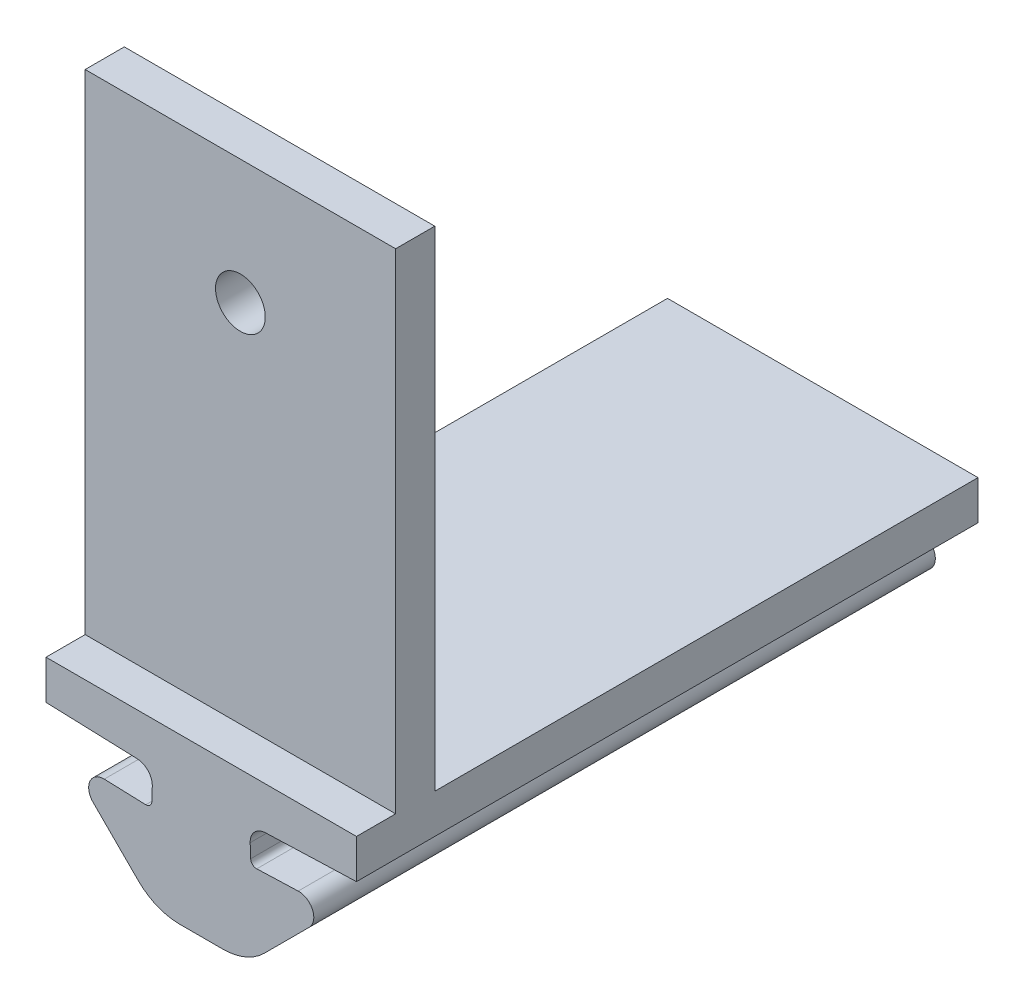
ISO-10303-21;
HEADER;
FILE_DESCRIPTION(('STEP AP214'),'2;1');
FILE_NAME('part.step','',(''),(''),'','','');
FILE_SCHEMA(('AUTOMOTIVE_DESIGN { 1 0 10303 214 1 1 1 1 }'));
ENDSEC;
DATA;
#1=APPLICATION_CONTEXT('core data for automotive mechanical design processes');
#2=APPLICATION_PROTOCOL_DEFINITION('international standard','automotive_design',2000,#1);
#3=PRODUCT_CONTEXT('',#1,'mechanical');
#4=PRODUCT('Part','Part','',(#3));
#5=PRODUCT_RELATED_PRODUCT_CATEGORY('part','',(#4));
#6=PRODUCT_DEFINITION_FORMATION('','',#4);
#7=PRODUCT_DEFINITION_CONTEXT('part definition',#1,'design');
#8=PRODUCT_DEFINITION('design','',#6,#7);
#9=PRODUCT_DEFINITION_SHAPE('','',#8);
#10=(LENGTH_UNIT() NAMED_UNIT(*) SI_UNIT(.MILLI.,.METRE.));
#11=(NAMED_UNIT(*) PLANE_ANGLE_UNIT() SI_UNIT($,.RADIAN.));
#12=(NAMED_UNIT(*) SI_UNIT($,.STERADIAN.) SOLID_ANGLE_UNIT());
#13=UNCERTAINTY_MEASURE_WITH_UNIT(LENGTH_MEASURE(1.E-05),#10,'distance_accuracy_value','');
#14=(GEOMETRIC_REPRESENTATION_CONTEXT(3) GLOBAL_UNCERTAINTY_ASSIGNED_CONTEXT((#13)) GLOBAL_UNIT_ASSIGNED_CONTEXT((#10,
#11,#12)) REPRESENTATION_CONTEXT('',''));
#15=CARTESIAN_POINT('',(0.,0.,0.));
#16=DIRECTION('',(0.,0.,1.));
#17=DIRECTION('',(1.,0.,0.));
#18=AXIS2_PLACEMENT_3D('',#15,#16,#17);
#19=CARTESIAN_POINT('',(0.,49.2995338889829,0.));
#20=DIRECTION('',(0.,1.,0.));
#21=DIRECTION('',(0.,0.,1.));
#22=AXIS2_PLACEMENT_3D('',#19,#20,#21);
#23=PLANE('',#22);
#24=DIRECTION('',(-1.,0.,0.));
#25=VECTOR('',#24,1.);
#26=CARTESIAN_POINT('',(-55.7809025544344,49.2995338889829,27.75));
#27=LINE('',#26,#25);
#28=CARTESIAN_POINT('',(-39.9205005412442,49.2995338889829,27.75));
#29=VERTEX_POINT('',#28);
#30=CARTESIAN_POINT('',(-55.7809025544344,49.2995338889829,27.75));
#31=VERTEX_POINT('',#30);
#32=EDGE_CURVE('E63',#29,#31,#27,.T.);
#33=ORIENTED_EDGE('',*,*,#32,.F.);
#34=DIRECTION('',(0.,0.,-1.));
#35=VECTOR('',#34,1.);
#36=CARTESIAN_POINT('',(-39.9205005412442,49.2995338889829,0.));
#37=LINE('',#36,#35);
#38=CARTESIAN_POINT('',(-39.9205005412442,49.2995338889829,0.));
#39=VERTEX_POINT('',#38);
#40=EDGE_CURVE('E249',#29,#39,#37,.T.);
#41=ORIENTED_EDGE('',*,*,#40,.T.);
#42=DIRECTION('',(-1.,0.,0.));
#43=VECTOR('',#42,1.);
#44=CARTESIAN_POINT('',(-55.7809025544344,49.2995338889829,0.));
#45=LINE('',#44,#43);
#46=CARTESIAN_POINT('',(-55.7809025544344,49.2995338889829,0.));
#47=VERTEX_POINT('',#46);
#48=EDGE_CURVE('E253',#39,#47,#45,.T.);
#49=ORIENTED_EDGE('',*,*,#48,.T.);
#50=DIRECTION('',(0.,0.,1.));
#51=VECTOR('',#50,1.);
#52=CARTESIAN_POINT('',(-55.7809025544344,49.2995338889829,0.));
#53=LINE('',#52,#51);
#54=EDGE_CURVE('E239',#47,#31,#53,.T.);
#55=ORIENTED_EDGE('',*,*,#54,.T.);
#56=EDGE_LOOP('',(#33,#41,#49,#55));
#57=FACE_BOUND('',#56,.T.);
#58=ADVANCED_FACE('F47',(#57),#23,.T.);
#59=CARTESIAN_POINT('',(-50.6754357820215,45.6203327442278,31.75));
#60=DIRECTION('',(0.,0.,-1.));
#61=DIRECTION('',(-1.,0.,0.));
#62=AXIS2_PLACEMENT_3D('',#59,#60,#61);
#63=CYLINDRICAL_SURFACE('',#62,0.300000000000002);
#64=CARTESIAN_POINT('',(-50.6754357820215,45.6203327442278,0.));
#65=DIRECTION('',(0.,0.,-1.));
#66=DIRECTION('',(1.,0.,0.));
#67=AXIS2_PLACEMENT_3D('',#64,#65,#66);
#68=CIRCLE('',#67,0.300000000000002);
#69=CARTESIAN_POINT('',(-50.3756185339158,45.609862895217,0.));
#70=VERTEX_POINT('',#69);
#71=CARTESIAN_POINT('',(-50.6859056310322,45.320515496122,0.));
#72=VERTEX_POINT('',#71);
#73=EDGE_CURVE('E365',#70,#72,#68,.T.);
#74=ORIENTED_EDGE('',*,*,#73,.T.);
#75=DIRECTION('',(0.,0.,-1.));
#76=VECTOR('',#75,1.);
#77=CARTESIAN_POINT('',(-50.6859056310322,45.320515496122,31.75));
#78=LINE('',#77,#76);
#79=CARTESIAN_POINT('',(-50.6859056310322,45.320515496122,31.75));
#80=VERTEX_POINT('',#79);
#81=EDGE_CURVE('E11',#80,#72,#78,.T.);
#82=ORIENTED_EDGE('',*,*,#81,.F.);
#83=CARTESIAN_POINT('',(-50.6754357820215,45.6203327442278,31.75));
#84=DIRECTION('',(0.,0.,-1.));
#85=DIRECTION('',(1.,0.,0.));
#86=AXIS2_PLACEMENT_3D('',#83,#84,#85);
#87=CIRCLE('',#86,0.300000000000002);
#88=CARTESIAN_POINT('',(-50.3756185339158,45.609862895217,31.75));
#89=VERTEX_POINT('',#88);
#90=EDGE_CURVE('E366',#89,#80,#87,.T.);
#91=ORIENTED_EDGE('',*,*,#90,.F.);
#92=DIRECTION('',(0.,0.,-1.));
#93=VECTOR('',#92,1.);
#94=CARTESIAN_POINT('',(-50.3756185339158,45.609862895217,31.75));
#95=LINE('',#94,#93);
#96=EDGE_CURVE('E395',#89,#70,#95,.T.);
#97=ORIENTED_EDGE('',*,*,#96,.T.);
#98=EDGE_LOOP('',(#74,#82,#91,#97));
#99=FACE_BOUND('',#98,.T.);
#100=ADVANCED_FACE('F49',(#99),#63,.F.);
#101=CARTESIAN_POINT('',(-50.6859056310322,45.320515496122,31.75));
#102=DIRECTION('',(-0.0348994967024436,-0.999390827019098,0.));
#103=DIRECTION('',(0.999390827019098,-0.0348994967024436,0.));
#104=AXIS2_PLACEMENT_3D('',#101,#102,#103);
#105=PLANE('',#104);
#106=DIRECTION('',(-0.999390827019098,0.0348994967024436,0.));
#107=VECTOR('',#106,1.);
#108=CARTESIAN_POINT('',(-50.6859056310322,45.320515496122,0.));
#109=LINE('',#108,#107);
#110=CARTESIAN_POINT('',(-52.803734095959,45.3944716957687,0.));
#111=VERTEX_POINT('',#110);
#112=EDGE_CURVE('E399',#72,#111,#109,.T.);
#113=ORIENTED_EDGE('',*,*,#112,.T.);
#114=DIRECTION('',(0.,0.,-1.));
#115=VECTOR('',#114,1.);
#116=CARTESIAN_POINT('',(-52.803734095959,45.3944716957687,31.75));
#117=LINE('',#116,#115);
#118=CARTESIAN_POINT('',(-52.803734095959,45.3944716957687,31.75));
#119=VERTEX_POINT('',#118);
#120=EDGE_CURVE('E56',#119,#111,#117,.T.);
#121=ORIENTED_EDGE('',*,*,#120,.F.);
#122=DIRECTION('',(-0.999390827019098,0.0348994967024436,0.));
#123=VECTOR('',#122,1.);
#124=CARTESIAN_POINT('',(-50.6859056310322,45.320515496122,31.75));
#125=LINE('',#124,#123);
#126=EDGE_CURVE('E370',#80,#119,#125,.T.);
#127=ORIENTED_EDGE('',*,*,#126,.F.);
#128=ORIENTED_EDGE('',*,*,#81,.T.);
#129=EDGE_LOOP('',(#113,#121,#127,#128));
#130=FACE_BOUND('',#129,.T.);
#131=ADVANCED_FACE('F477',(#130),#105,.F.);
#132=CARTESIAN_POINT('',(-52.8306099066512,44.6248491736012,31.75));
#133=DIRECTION('',(0.,0.,-1.));
#134=DIRECTION('',(-1.,0.,0.));
#135=AXIS2_PLACEMENT_3D('',#132,#133,#134);
#136=CYLINDRICAL_SURFACE('',#135,0.770091641188153);
#137=CARTESIAN_POINT('',(-52.8306099066512,44.6248491736012,0.));
#138=DIRECTION('',(0.,0.,1.));
#139=DIRECTION('',(1.,0.,0.));
#140=AXIS2_PLACEMENT_3D('',#137,#138,#139);
#141=CIRCLE('',#140,0.770091641188153);
#142=CARTESIAN_POINT('',(-53.3751469282704,44.0803121519819,0.));
#143=VERTEX_POINT('',#142);
#144=EDGE_CURVE('E402',#111,#143,#141,.T.);
#145=ORIENTED_EDGE('',*,*,#144,.T.);
#146=DIRECTION('',(0.,0.,-1.));
#147=VECTOR('',#146,1.);
#148=CARTESIAN_POINT('',(-53.3751469282704,44.0803121519819,31.75));
#149=LINE('',#148,#147);
#150=CARTESIAN_POINT('',(-53.3751469282704,44.0803121519819,31.75));
#151=VERTEX_POINT('',#150);
#152=EDGE_CURVE('E444',#151,#143,#149,.T.);
#153=ORIENTED_EDGE('',*,*,#152,.F.);
#154=CARTESIAN_POINT('',(-52.8306099066512,44.6248491736012,31.75));
#155=DIRECTION('',(0.,0.,1.));
#156=DIRECTION('',(1.,0.,0.));
#157=AXIS2_PLACEMENT_3D('',#154,#155,#156);
#158=CIRCLE('',#157,0.770091641188153);
#159=EDGE_CURVE('E374',#119,#151,#158,.T.);
#160=ORIENTED_EDGE('',*,*,#159,.F.);
#161=ORIENTED_EDGE('',*,*,#120,.T.);
#162=EDGE_LOOP('',(#145,#153,#160,#161));
#163=FACE_BOUND('',#162,.T.);
#164=ADVANCED_FACE('F453',(#163),#136,.T.);
#165=CARTESIAN_POINT('',(-51.0742666676735,41.7794318913851,31.75));
#166=DIRECTION('',(0.707106781186544,0.707106781186551,0.));
#167=DIRECTION('',(-0.707106781186551,0.707106781186544,0.));
#168=AXIS2_PLACEMENT_3D('',#165,#166,#167);
#169=PLANE('',#168);
#170=DIRECTION('',(0.707106781186551,-0.707106781186544,0.));
#171=VECTOR('',#170,1.);
#172=CARTESIAN_POINT('',(-51.0742666676735,41.7794318913851,0.));
#173=LINE('',#172,#171);
#174=CARTESIAN_POINT('',(-51.0742666676735,41.7794318913851,0.));
#175=VERTEX_POINT('',#174);
#176=EDGE_CURVE('E405',#143,#175,#173,.T.);
#177=ORIENTED_EDGE('',*,*,#176,.T.);
#178=DIRECTION('',(0.,0.,-1.));
#179=VECTOR('',#178,1.);
#180=CARTESIAN_POINT('',(-51.0742666676735,41.7794318913851,31.75));
#181=LINE('',#180,#179);
#182=CARTESIAN_POINT('',(-51.0742666676735,41.7794318913851,31.75));
#183=VERTEX_POINT('',#182);
#184=EDGE_CURVE('E440',#183,#175,#181,.T.);
#185=ORIENTED_EDGE('',*,*,#184,.F.);
#186=DIRECTION('',(0.707106781186551,-0.707106781186544,0.));
#187=VECTOR('',#186,1.);
#188=CARTESIAN_POINT('',(-51.0742666676735,41.7794318913851,31.75));
#189=LINE('',#188,#187);
#190=EDGE_CURVE('E377',#151,#183,#189,.T.);
#191=ORIENTED_EDGE('',*,*,#190,.F.);
#192=ORIENTED_EDGE('',*,*,#152,.T.);
#193=EDGE_LOOP('',(#177,#185,#191,#192));
#194=FACE_BOUND('',#193,.T.);
#195=ADVANCED_FACE('F464',(#194),#169,.F.);
#196=CARTESIAN_POINT('',(-48.9529463241139,43.9007522349447,31.75));
#197=DIRECTION('',(0.,0.,-1.));
#198=DIRECTION('',(-1.,0.,0.));
#199=AXIS2_PLACEMENT_3D('',#196,#197,#198);
#200=CYLINDRICAL_SURFACE('',#199,3.);
#201=CARTESIAN_POINT('',(-48.9529463241139,43.9007522349447,0.));
#202=DIRECTION('',(0.,0.,1.));
#203=DIRECTION('',(1.,0.,0.));
#204=AXIS2_PLACEMENT_3D('',#201,#202,#203);
#205=CIRCLE('',#204,3.);
#206=CARTESIAN_POINT('',(-48.9529463241139,40.9007522349447,0.));
#207=VERTEX_POINT('',#206);
#208=EDGE_CURVE('E408',#175,#207,#205,.T.);
#209=ORIENTED_EDGE('',*,*,#208,.T.);
#210=DIRECTION('',(0.,0.,-1.));
#211=VECTOR('',#210,1.);
#212=CARTESIAN_POINT('',(-48.9529463241139,40.9007522349447,31.75));
#213=LINE('',#212,#211);
#214=CARTESIAN_POINT('',(-48.9529463241139,40.9007522349447,31.75));
#215=VERTEX_POINT('',#214);
#216=EDGE_CURVE('E436',#215,#207,#213,.T.);
#217=ORIENTED_EDGE('',*,*,#216,.F.);
#218=CARTESIAN_POINT('',(-48.9529463241139,43.9007522349447,31.75));
#219=DIRECTION('',(0.,0.,1.));
#220=DIRECTION('',(1.,0.,0.));
#221=AXIS2_PLACEMENT_3D('',#218,#219,#220);
#222=CIRCLE('',#221,3.);
#223=EDGE_CURVE('E380',#183,#215,#222,.T.);
#224=ORIENTED_EDGE('',*,*,#223,.F.);
#225=ORIENTED_EDGE('',*,*,#184,.T.);
#226=EDGE_LOOP('',(#209,#217,#224,#225));
#227=FACE_BOUND('',#226,.T.);
#228=ADVANCED_FACE('F468',(#227),#200,.T.);
#229=CARTESIAN_POINT('',(-47.8507015478393,40.9007522349447,31.75));
#230=DIRECTION('',(0.,1.,0.));
#231=DIRECTION('',(0.,0.,1.));
#232=AXIS2_PLACEMENT_3D('',#229,#230,#231);
#233=PLANE('',#232);
#234=DIRECTION('',(1.,0.,0.));
#235=VECTOR('',#234,1.);
#236=CARTESIAN_POINT('',(-47.8507015478393,40.9007522349447,0.));
#237=LINE('',#236,#235);
#238=CARTESIAN_POINT('',(-46.7484567715648,40.9007522349447,0.));
#239=VERTEX_POINT('',#238);
#240=EDGE_CURVE('E411',#207,#239,#237,.T.);
#241=ORIENTED_EDGE('',*,*,#240,.T.);
#242=DIRECTION('',(0.,0.,-1.));
#243=VECTOR('',#242,1.);
#244=CARTESIAN_POINT('',(-46.7484567715648,40.9007522349447,31.75));
#245=LINE('',#244,#243);
#246=CARTESIAN_POINT('',(-46.7484567715648,40.9007522349447,31.75));
#247=VERTEX_POINT('',#246);
#248=EDGE_CURVE('E348',#247,#239,#245,.T.);
#249=ORIENTED_EDGE('',*,*,#248,.F.);
#250=DIRECTION('',(1.,0.,0.));
#251=VECTOR('',#250,1.);
#252=CARTESIAN_POINT('',(-47.8507015478393,40.9007522349447,31.75));
#253=LINE('',#252,#251);
#254=EDGE_CURVE('E383',#215,#247,#253,.T.);
#255=ORIENTED_EDGE('',*,*,#254,.F.);
#256=ORIENTED_EDGE('',*,*,#216,.T.);
#257=EDGE_LOOP('',(#241,#249,#255,#256));
#258=FACE_BOUND('',#257,.T.);
#259=ADVANCED_FACE('F595',(#258),#233,.F.);
#260=CARTESIAN_POINT('',(-55.7809025544344,47.2995338889829,31.75));
#261=DIRECTION('',(0.0348994967024436,0.999390827019098,0.));
#262=DIRECTION('',(-0.999390827019098,0.0348994967024436,0.));
#263=AXIS2_PLACEMENT_3D('',#260,#261,#262);
#264=PLANE('',#263);
#265=DIRECTION('',(0.999390827019098,-0.0348994967024436,0.));
#266=VECTOR('',#265,1.);
#267=CARTESIAN_POINT('',(-55.7809025544344,47.2995338889829,0.));
#268=LINE('',#267,#266);
#269=CARTESIAN_POINT('',(-55.7809025544344,47.2995338889829,0.));
#270=VERTEX_POINT('',#269);
#271=CARTESIAN_POINT('',(-51.1227819504774,47.1368687331076,0.));
#272=VERTEX_POINT('',#271);
#273=EDGE_CURVE('E414',#270,#272,#268,.T.);
#274=ORIENTED_EDGE('',*,*,#273,.T.);
#275=DIRECTION('',(0.,0.,-1.));
#276=VECTOR('',#275,1.);
#277=CARTESIAN_POINT('',(-51.1227819504774,47.1368687331076,31.75));
#278=LINE('',#277,#276);
#279=CARTESIAN_POINT('',(-51.1227819504774,47.1368687331076,31.75));
#280=VERTEX_POINT('',#279);
#281=EDGE_CURVE('E429',#280,#272,#278,.T.);
#282=ORIENTED_EDGE('',*,*,#281,.F.);
#283=DIRECTION('',(0.999390827019098,-0.0348994967024436,0.));
#284=VECTOR('',#283,1.);
#285=CARTESIAN_POINT('',(-55.7809025544344,47.2995338889829,31.75));
#286=LINE('',#285,#284);
#287=CARTESIAN_POINT('',(-55.7809025544344,47.2995338889829,31.75));
#288=VERTEX_POINT('',#287);
#289=EDGE_CURVE('E386',#288,#280,#286,.T.);
#290=ORIENTED_EDGE('',*,*,#289,.F.);
#291=DIRECTION('',(0.,0.,-1.));
#292=VECTOR('',#291,1.);
#293=CARTESIAN_POINT('',(-55.7809025544344,47.2995338889829,31.75));
#294=LINE('',#293,#292);
#295=EDGE_CURVE('E433',#288,#270,#294,.T.);
#296=ORIENTED_EDGE('',*,*,#295,.T.);
#297=EDGE_LOOP('',(#274,#282,#290,#296));
#298=FACE_BOUND('',#297,.T.);
#299=ADVANCED_FACE('F492',(#298),#264,.F.);
#300=CARTESIAN_POINT('',(-51.1507015478393,46.3373560714924,31.75));
#301=DIRECTION('',(0.,0.,-1.));
#302=DIRECTION('',(-1.,0.,0.));
#303=AXIS2_PLACEMENT_3D('',#300,#301,#302);
#304=CYLINDRICAL_SURFACE('',#303,0.799999999999997);
#305=CARTESIAN_POINT('',(-51.1507015478393,46.3373560714924,0.));
#306=DIRECTION('',(0.,0.,-1.));
#307=DIRECTION('',(1.,0.,0.));
#308=AXIS2_PLACEMENT_3D('',#305,#306,#307);
#309=CIRCLE('',#308,0.799999999999997);
#310=CARTESIAN_POINT('',(-50.3511888862241,46.3094364741304,0.));
#311=VERTEX_POINT('',#310);
#312=EDGE_CURVE('E417',#272,#311,#309,.T.);
#313=ORIENTED_EDGE('',*,*,#312,.T.);
#314=DIRECTION('',(0.,0.,-1.));
#315=VECTOR('',#314,1.);
#316=CARTESIAN_POINT('',(-50.3511888862241,46.3094364741304,31.75));
#317=LINE('',#316,#315);
#318=CARTESIAN_POINT('',(-50.3511888862241,46.3094364741304,31.75));
#319=VERTEX_POINT('',#318);
#320=EDGE_CURVE('E425',#319,#311,#317,.T.);
#321=ORIENTED_EDGE('',*,*,#320,.F.);
#322=CARTESIAN_POINT('',(-51.1507015478393,46.3373560714924,31.75));
#323=DIRECTION('',(0.,0.,-1.));
#324=DIRECTION('',(1.,0.,0.));
#325=AXIS2_PLACEMENT_3D('',#322,#323,#324);
#326=CIRCLE('',#325,0.799999999999997);
#327=EDGE_CURVE('E389',#280,#319,#326,.T.);
#328=ORIENTED_EDGE('',*,*,#327,.F.);
#329=ORIENTED_EDGE('',*,*,#281,.T.);
#330=EDGE_LOOP('',(#313,#321,#328,#329));
#331=FACE_BOUND('',#330,.T.);
#332=ADVANCED_FACE('F489',(#331),#304,.F.);
#333=CARTESIAN_POINT('',(-50.3756185339158,45.609862895217,31.75));
#334=DIRECTION('',(0.999390827019098,-0.034899496702436,0.));
#335=DIRECTION('',(0.034899496702436,0.999390827019098,0.));
#336=AXIS2_PLACEMENT_3D('',#333,#334,#335);
#337=PLANE('',#336);
#338=DIRECTION('',(-0.034899496702436,-0.999390827019098,0.));
#339=VECTOR('',#338,1.);
#340=CARTESIAN_POINT('',(-50.3756185339158,45.609862895217,0.));
#341=LINE('',#340,#339);
#342=EDGE_CURVE('E371',#311,#70,#341,.T.);
#343=ORIENTED_EDGE('',*,*,#342,.T.);
#344=ORIENTED_EDGE('',*,*,#96,.F.);
#345=DIRECTION('',(-0.034899496702436,-0.999390827019098,0.));
#346=VECTOR('',#345,1.);
#347=CARTESIAN_POINT('',(-50.3756185339158,45.609862895217,31.75));
#348=LINE('',#347,#346);
#349=EDGE_CURVE('E392',#319,#89,#348,.T.);
#350=ORIENTED_EDGE('',*,*,#349,.F.);
#351=ORIENTED_EDGE('',*,*,#320,.T.);
#352=EDGE_LOOP('',(#343,#344,#350,#351));
#353=FACE_BOUND('',#352,.T.);
#354=ADVANCED_FACE('F484',(#353),#337,.F.);
#355=CARTESIAN_POINT('',(-50.6754357820215,45.6203327442278,31.75));
#356=DIRECTION('',(0.,0.,1.));
#357=DIRECTION('',(1.,0.,0.));
#358=AXIS2_PLACEMENT_3D('',#355,#356,#357);
#359=PLANE('',#358);
#360=ORIENTED_EDGE('',*,*,#90,.T.);
#361=ORIENTED_EDGE('',*,*,#126,.T.);
#362=ORIENTED_EDGE('',*,*,#159,.T.);
#363=ORIENTED_EDGE('',*,*,#190,.T.);
#364=ORIENTED_EDGE('',*,*,#223,.T.);
#365=ORIENTED_EDGE('',*,*,#254,.T.);
#366=CARTESIAN_POINT('',(-46.7484567715648,43.9007522349447,31.75));
#367=DIRECTION('',(0.,0.,-1.));
#368=DIRECTION('',(-1.,0.,0.));
#369=AXIS2_PLACEMENT_3D('',#366,#367,#368);
#370=CIRCLE('',#369,3.);
#371=CARTESIAN_POINT('',(-44.6271364280052,41.7794318913851,31.75));
#372=VERTEX_POINT('',#371);
#373=EDGE_CURVE('E290',#372,#247,#370,.T.);
#374=ORIENTED_EDGE('',*,*,#373,.F.);
#375=DIRECTION('',(-0.707106781186551,-0.707106781186544,0.));
#376=VECTOR('',#375,1.);
#377=CARTESIAN_POINT('',(-44.6271364280052,41.7794318913851,31.75));
#378=LINE('',#377,#376);
#379=CARTESIAN_POINT('',(-42.3262561674083,44.0803121519819,31.75));
#380=VERTEX_POINT('',#379);
#381=EDGE_CURVE('E294',#380,#372,#378,.T.);
#382=ORIENTED_EDGE('',*,*,#381,.F.);
#383=CARTESIAN_POINT('',(-42.8707931890275,44.6248491736012,31.75));
#384=DIRECTION('',(0.,0.,-1.));
#385=DIRECTION('',(-1.,0.,0.));
#386=AXIS2_PLACEMENT_3D('',#383,#384,#385);
#387=CIRCLE('',#386,0.770091641188153);
#388=CARTESIAN_POINT('',(-42.8976689997197,45.3944716957687,31.75));
#389=VERTEX_POINT('',#388);
#390=EDGE_CURVE('E298',#389,#380,#387,.T.);
#391=ORIENTED_EDGE('',*,*,#390,.F.);
#392=DIRECTION('',(0.999390827019098,0.0348994967024436,0.));
#393=VECTOR('',#392,1.);
#394=CARTESIAN_POINT('',(-45.0154974646464,45.320515496122,31.75));
#395=LINE('',#394,#393);
#396=CARTESIAN_POINT('',(-45.0154974646464,45.320515496122,31.75));
#397=VERTEX_POINT('',#396);
#398=EDGE_CURVE('E302',#397,#389,#395,.T.);
#399=ORIENTED_EDGE('',*,*,#398,.F.);
#400=CARTESIAN_POINT('',(-45.0259673136572,45.6203327442278,31.75));
#401=DIRECTION('',(0.,0.,1.));
#402=DIRECTION('',(-1.,0.,0.));
#403=AXIS2_PLACEMENT_3D('',#400,#401,#402);
#404=CIRCLE('',#403,0.300000000000002);
#405=CARTESIAN_POINT('',(-45.3257845617629,45.609862895217,31.75));
#406=VERTEX_POINT('',#405);
#407=EDGE_CURVE('E273',#406,#397,#404,.T.);
#408=ORIENTED_EDGE('',*,*,#407,.F.);
#409=DIRECTION('',(0.034899496702436,-0.999390827019098,0.));
#410=VECTOR('',#409,1.);
#411=CARTESIAN_POINT('',(-45.3257845617629,45.609862895217,31.75));
#412=LINE('',#411,#410);
#413=CARTESIAN_POINT('',(-45.3502142094546,46.3094364741304,31.75));
#414=VERTEX_POINT('',#413);
#415=EDGE_CURVE('E277',#414,#406,#412,.T.);
#416=ORIENTED_EDGE('',*,*,#415,.F.);
#417=CARTESIAN_POINT('',(-44.5507015478393,46.3373560714924,31.75));
#418=DIRECTION('',(0.,0.,1.));
#419=DIRECTION('',(-1.,0.,0.));
#420=AXIS2_PLACEMENT_3D('',#417,#418,#419);
#421=CIRCLE('',#420,0.799999999999997);
#422=CARTESIAN_POINT('',(-44.5786211452013,47.1368687331076,31.75));
#423=VERTEX_POINT('',#422);
#424=EDGE_CURVE('E282',#423,#414,#421,.T.);
#425=ORIENTED_EDGE('',*,*,#424,.F.);
#426=DIRECTION('',(-0.999390827019098,-0.0348994967024436,0.));
#427=VECTOR('',#426,1.);
#428=CARTESIAN_POINT('',(-39.9205005412442,47.2995338889829,31.75));
#429=LINE('',#428,#427);
#430=CARTESIAN_POINT('',(-39.9205005412442,47.2995338889829,31.75));
#431=VERTEX_POINT('',#430);
#432=EDGE_CURVE('E286',#431,#423,#429,.T.);
#433=ORIENTED_EDGE('',*,*,#432,.F.);
#434=DIRECTION('',(0.,-1.,0.));
#435=VECTOR('',#434,1.);
#436=CARTESIAN_POINT('',(-39.9205005412442,49.2995338889829,31.75));
#437=LINE('',#436,#435);
#438=CARTESIAN_POINT('',(-39.9205005412442,49.2995338889829,31.75));
#439=VERTEX_POINT('',#438);
#440=EDGE_CURVE('E264',#439,#431,#437,.T.);
#441=ORIENTED_EDGE('',*,*,#440,.F.);
#442=DIRECTION('',(1.,0.,0.));
#443=VECTOR('',#442,1.);
#444=CARTESIAN_POINT('',(-55.7809025544344,49.2995338889829,31.75));
#445=LINE('',#444,#443);
#446=CARTESIAN_POINT('',(-55.7809025544344,49.2995338889829,31.75));
#447=VERTEX_POINT('',#446);
#448=EDGE_CURVE('E246',#447,#439,#445,.T.);
#449=ORIENTED_EDGE('',*,*,#448,.F.);
#450=DIRECTION('',(0.,-1.,0.));
#451=VECTOR('',#450,1.);
#452=CARTESIAN_POINT('',(-55.7809025544344,49.2995338889829,31.75));
#453=LINE('',#452,#451);
#454=EDGE_CURVE('E268',#447,#288,#453,.T.);
#455=ORIENTED_EDGE('',*,*,#454,.T.);
#456=ORIENTED_EDGE('',*,*,#289,.T.);
#457=ORIENTED_EDGE('',*,*,#327,.T.);
#458=ORIENTED_EDGE('',*,*,#349,.T.);
#459=EDGE_LOOP('',(#360,#361,#362,#363,#364,#365,#374,#382,#391,#399,#408,#416,#425,#433,#441,
#449,#455,#456,#457,#458));
#460=FACE_BOUND('',#459,.T.);
#461=ADVANCED_FACE('F472',(#460),#359,.T.);
#462=CARTESIAN_POINT('',(-50.6754357820215,45.6203327442278,0.));
#463=DIRECTION('',(0.,0.,1.));
#464=DIRECTION('',(1.,0.,0.));
#465=AXIS2_PLACEMENT_3D('',#462,#463,#464);
#466=PLANE('',#465);
#467=ORIENTED_EDGE('',*,*,#73,.F.);
#468=ORIENTED_EDGE('',*,*,#342,.F.);
#469=ORIENTED_EDGE('',*,*,#312,.F.);
#470=ORIENTED_EDGE('',*,*,#273,.F.);
#471=DIRECTION('',(0.,-1.,0.));
#472=VECTOR('',#471,1.);
#473=CARTESIAN_POINT('',(-55.7809025544344,49.2995338889829,0.));
#474=LINE('',#473,#472);
#475=EDGE_CURVE('E256',#47,#270,#474,.T.);
#476=ORIENTED_EDGE('',*,*,#475,.F.);
#477=ORIENTED_EDGE('',*,*,#48,.F.);
#478=DIRECTION('',(0.,-1.,0.));
#479=VECTOR('',#478,1.);
#480=CARTESIAN_POINT('',(-39.9205005412442,49.2995338889829,0.));
#481=LINE('',#480,#479);
#482=CARTESIAN_POINT('',(-39.9205005412442,47.2995338889829,0.));
#483=VERTEX_POINT('',#482);
#484=EDGE_CURVE('E260',#39,#483,#481,.T.);
#485=ORIENTED_EDGE('',*,*,#484,.T.);
#486=DIRECTION('',(-0.999390827019098,-0.0348994967024436,0.));
#487=VECTOR('',#486,1.);
#488=CARTESIAN_POINT('',(-39.9205005412442,47.2995338889829,0.));
#489=LINE('',#488,#487);
#490=CARTESIAN_POINT('',(-44.5786211452013,47.1368687331076,0.));
#491=VERTEX_POINT('',#490);
#492=EDGE_CURVE('E318',#483,#491,#489,.T.);
#493=ORIENTED_EDGE('',*,*,#492,.T.);
#494=CARTESIAN_POINT('',(-44.5507015478393,46.3373560714924,0.));
#495=DIRECTION('',(0.,0.,1.));
#496=DIRECTION('',(-1.,0.,0.));
#497=AXIS2_PLACEMENT_3D('',#494,#495,#496);
#498=CIRCLE('',#497,0.799999999999997);
#499=CARTESIAN_POINT('',(-45.3502142094546,46.3094364741304,0.));
#500=VERTEX_POINT('',#499);
#501=EDGE_CURVE('E314',#491,#500,#498,.T.);
#502=ORIENTED_EDGE('',*,*,#501,.T.);
#503=DIRECTION('',(0.034899496702436,-0.999390827019098,0.));
#504=VECTOR('',#503,1.);
#505=CARTESIAN_POINT('',(-45.3257845617629,45.609862895217,0.));
#506=LINE('',#505,#504);
#507=CARTESIAN_POINT('',(-45.3257845617629,45.609862895217,0.));
#508=VERTEX_POINT('',#507);
#509=EDGE_CURVE('E310',#500,#508,#506,.T.);
#510=ORIENTED_EDGE('',*,*,#509,.T.);
#511=CARTESIAN_POINT('',(-45.0259673136572,45.6203327442278,0.));
#512=DIRECTION('',(0.,0.,1.));
#513=DIRECTION('',(-1.,0.,0.));
#514=AXIS2_PLACEMENT_3D('',#511,#512,#513);
#515=CIRCLE('',#514,0.300000000000002);
#516=CARTESIAN_POINT('',(-45.0154974646464,45.320515496122,0.));
#517=VERTEX_POINT('',#516);
#518=EDGE_CURVE('E272',#508,#517,#515,.T.);
#519=ORIENTED_EDGE('',*,*,#518,.T.);
#520=DIRECTION('',(0.999390827019098,0.0348994967024436,0.));
#521=VECTOR('',#520,1.);
#522=CARTESIAN_POINT('',(-45.0154974646464,45.320515496122,0.));
#523=LINE('',#522,#521);
#524=CARTESIAN_POINT('',(-42.8976689997197,45.3944716957687,0.));
#525=VERTEX_POINT('',#524);
#526=EDGE_CURVE('E278',#517,#525,#523,.T.);
#527=ORIENTED_EDGE('',*,*,#526,.T.);
#528=CARTESIAN_POINT('',(-42.8707931890275,44.6248491736012,0.));
#529=DIRECTION('',(0.,0.,-1.));
#530=DIRECTION('',(-1.,0.,0.));
#531=AXIS2_PLACEMENT_3D('',#528,#529,#530);
#532=CIRCLE('',#531,0.770091641188153);
#533=CARTESIAN_POINT('',(-42.3262561674083,44.0803121519819,0.));
#534=VERTEX_POINT('',#533);
#535=EDGE_CURVE('E330',#525,#534,#532,.T.);
#536=ORIENTED_EDGE('',*,*,#535,.T.);
#537=DIRECTION('',(-0.707106781186551,-0.707106781186544,0.));
#538=VECTOR('',#537,1.);
#539=CARTESIAN_POINT('',(-44.6271364280052,41.7794318913851,0.));
#540=LINE('',#539,#538);
#541=CARTESIAN_POINT('',(-44.6271364280052,41.7794318913851,0.));
#542=VERTEX_POINT('',#541);
#543=EDGE_CURVE('E326',#534,#542,#540,.T.);
#544=ORIENTED_EDGE('',*,*,#543,.T.);
#545=CARTESIAN_POINT('',(-46.7484567715648,43.9007522349447,0.));
#546=DIRECTION('',(0.,0.,-1.));
#547=DIRECTION('',(-1.,0.,0.));
#548=AXIS2_PLACEMENT_3D('',#545,#546,#547);
#549=CIRCLE('',#548,3.);
#550=EDGE_CURVE('E322',#542,#239,#549,.T.);
#551=ORIENTED_EDGE('',*,*,#550,.T.);
#552=ORIENTED_EDGE('',*,*,#240,.F.);
#553=ORIENTED_EDGE('',*,*,#208,.F.);
#554=ORIENTED_EDGE('',*,*,#176,.F.);
#555=ORIENTED_EDGE('',*,*,#144,.F.);
#556=ORIENTED_EDGE('',*,*,#112,.F.);
#557=EDGE_LOOP('',(#467,#468,#469,#470,#476,#477,#485,#493,#502,#510,#519,#527,#536,#544,#551,
#552,#553,#554,#555,#556));
#558=FACE_BOUND('',#557,.T.);
#559=ADVANCED_FACE('F459',(#558),#466,.F.);
#560=CARTESIAN_POINT('',(-45.0259673136572,45.6203327442278,31.75));
#561=DIRECTION('',(0.,0.,-1.));
#562=DIRECTION('',(-1.,0.,0.));
#563=AXIS2_PLACEMENT_3D('',#560,#561,#562);
#564=CYLINDRICAL_SURFACE('',#563,0.300000000000002);
#565=ORIENTED_EDGE('',*,*,#518,.F.);
#566=DIRECTION('',(0.,0.,-1.));
#567=VECTOR('',#566,1.);
#568=CARTESIAN_POINT('',(-45.3257845617629,45.609862895217,31.75));
#569=LINE('',#568,#567);
#570=EDGE_CURVE('E362',#406,#508,#569,.T.);
#571=ORIENTED_EDGE('',*,*,#570,.F.);
#572=ORIENTED_EDGE('',*,*,#407,.T.);
#573=DIRECTION('',(0.,0.,-1.));
#574=VECTOR('',#573,1.);
#575=CARTESIAN_POINT('',(-45.0154974646464,45.320515496122,31.75));
#576=LINE('',#575,#574);
#577=EDGE_CURVE('E306',#397,#517,#576,.T.);
#578=ORIENTED_EDGE('',*,*,#577,.T.);
#579=EDGE_LOOP('',(#565,#571,#572,#578));
#580=FACE_BOUND('',#579,.T.);
#581=ADVANCED_FACE('F580',(#580),#564,.F.);
#582=CARTESIAN_POINT('',(-45.3257845617629,45.609862895217,31.75));
#583=DIRECTION('',(0.999390827019098,0.034899496702436,0.));
#584=DIRECTION('',(-0.034899496702436,0.999390827019098,0.));
#585=AXIS2_PLACEMENT_3D('',#582,#583,#584);
#586=PLANE('',#585);
#587=ORIENTED_EDGE('',*,*,#509,.F.);
#588=DIRECTION('',(0.,0.,-1.));
#589=VECTOR('',#588,1.);
#590=CARTESIAN_POINT('',(-45.3502142094546,46.3094364741304,31.75));
#591=LINE('',#590,#589);
#592=EDGE_CURVE('E359',#414,#500,#591,.T.);
#593=ORIENTED_EDGE('',*,*,#592,.F.);
#594=ORIENTED_EDGE('',*,*,#415,.T.);
#595=ORIENTED_EDGE('',*,*,#570,.T.);
#596=EDGE_LOOP('',(#587,#593,#594,#595));
#597=FACE_BOUND('',#596,.T.);
#598=ADVANCED_FACE('F576',(#597),#586,.T.);
#599=CARTESIAN_POINT('',(-44.5507015478393,46.3373560714924,31.75));
#600=DIRECTION('',(0.,0.,-1.));
#601=DIRECTION('',(-1.,0.,0.));
#602=AXIS2_PLACEMENT_3D('',#599,#600,#601);
#603=CYLINDRICAL_SURFACE('',#602,0.799999999999997);
#604=ORIENTED_EDGE('',*,*,#501,.F.);
#605=DIRECTION('',(0.,0.,-1.));
#606=VECTOR('',#605,1.);
#607=CARTESIAN_POINT('',(-44.5786211452013,47.1368687331076,31.75));
#608=LINE('',#607,#606);
#609=EDGE_CURVE('E356',#423,#491,#608,.T.);
#610=ORIENTED_EDGE('',*,*,#609,.F.);
#611=ORIENTED_EDGE('',*,*,#424,.T.);
#612=ORIENTED_EDGE('',*,*,#592,.T.);
#613=EDGE_LOOP('',(#604,#610,#611,#612));
#614=FACE_BOUND('',#613,.T.);
#615=ADVANCED_FACE('F572',(#614),#603,.F.);
#616=CARTESIAN_POINT('',(-39.9205005412442,47.2995338889829,31.75));
#617=DIRECTION('',(0.0348994967024436,-0.999390827019098,0.));
#618=DIRECTION('',(0.999390827019098,0.0348994967024436,0.));
#619=AXIS2_PLACEMENT_3D('',#616,#617,#618);
#620=PLANE('',#619);
#621=ORIENTED_EDGE('',*,*,#492,.F.);
#622=DIRECTION('',(0.,0.,-1.));
#623=VECTOR('',#622,1.);
#624=CARTESIAN_POINT('',(-39.9205005412442,47.2995338889829,31.75));
#625=LINE('',#624,#623);
#626=EDGE_CURVE('E352',#431,#483,#625,.T.);
#627=ORIENTED_EDGE('',*,*,#626,.F.);
#628=ORIENTED_EDGE('',*,*,#432,.T.);
#629=ORIENTED_EDGE('',*,*,#609,.T.);
#630=EDGE_LOOP('',(#621,#627,#628,#629));
#631=FACE_BOUND('',#630,.T.);
#632=ADVANCED_FACE('F569',(#631),#620,.T.);
#633=CARTESIAN_POINT('',(-46.7484567715648,43.9007522349447,31.75));
#634=DIRECTION('',(0.,0.,-1.));
#635=DIRECTION('',(-1.,0.,0.));
#636=AXIS2_PLACEMENT_3D('',#633,#634,#635);
#637=CYLINDRICAL_SURFACE('',#636,3.);
#638=ORIENTED_EDGE('',*,*,#550,.F.);
#639=DIRECTION('',(0.,0.,-1.));
#640=VECTOR('',#639,1.);
#641=CARTESIAN_POINT('',(-44.6271364280052,41.7794318913851,31.75));
#642=LINE('',#641,#640);
#643=EDGE_CURVE('E345',#372,#542,#642,.T.);
#644=ORIENTED_EDGE('',*,*,#643,.F.);
#645=ORIENTED_EDGE('',*,*,#373,.T.);
#646=ORIENTED_EDGE('',*,*,#248,.T.);
#647=EDGE_LOOP('',(#638,#644,#645,#646));
#648=FACE_BOUND('',#647,.T.);
#649=ADVANCED_FACE('F565',(#648),#637,.T.);
#650=CARTESIAN_POINT('',(-44.6271364280052,41.7794318913851,31.75));
#651=DIRECTION('',(0.707106781186544,-0.707106781186551,0.));
#652=DIRECTION('',(0.707106781186551,0.707106781186544,0.));
#653=AXIS2_PLACEMENT_3D('',#650,#651,#652);
#654=PLANE('',#653);
#655=ORIENTED_EDGE('',*,*,#543,.F.);
#656=DIRECTION('',(0.,0.,-1.));
#657=VECTOR('',#656,1.);
#658=CARTESIAN_POINT('',(-42.3262561674083,44.0803121519819,31.75));
#659=LINE('',#658,#657);
#660=EDGE_CURVE('E342',#380,#534,#659,.T.);
#661=ORIENTED_EDGE('',*,*,#660,.F.);
#662=ORIENTED_EDGE('',*,*,#381,.T.);
#663=ORIENTED_EDGE('',*,*,#643,.T.);
#664=EDGE_LOOP('',(#655,#661,#662,#663));
#665=FACE_BOUND('',#664,.T.);
#666=ADVANCED_FACE('F561',(#665),#654,.T.);
#667=CARTESIAN_POINT('',(-42.8707931890275,44.6248491736012,31.75));
#668=DIRECTION('',(0.,0.,-1.));
#669=DIRECTION('',(-1.,0.,0.));
#670=AXIS2_PLACEMENT_3D('',#667,#668,#669);
#671=CYLINDRICAL_SURFACE('',#670,0.770091641188153);
#672=ORIENTED_EDGE('',*,*,#535,.F.);
#673=DIRECTION('',(0.,0.,-1.));
#674=VECTOR('',#673,1.);
#675=CARTESIAN_POINT('',(-42.8976689997197,45.3944716957687,31.75));
#676=LINE('',#675,#674);
#677=EDGE_CURVE('E339',#389,#525,#676,.T.);
#678=ORIENTED_EDGE('',*,*,#677,.F.);
#679=ORIENTED_EDGE('',*,*,#390,.T.);
#680=ORIENTED_EDGE('',*,*,#660,.T.);
#681=EDGE_LOOP('',(#672,#678,#679,#680));
#682=FACE_BOUND('',#681,.T.);
#683=ADVANCED_FACE('F557',(#682),#671,.T.);
#684=CARTESIAN_POINT('',(-45.0154974646464,45.320515496122,31.75));
#685=DIRECTION('',(-0.0348994967024436,0.999390827019098,0.));
#686=DIRECTION('',(-0.999390827019098,-0.0348994967024436,0.));
#687=AXIS2_PLACEMENT_3D('',#684,#685,#686);
#688=PLANE('',#687);
#689=ORIENTED_EDGE('',*,*,#526,.F.);
#690=ORIENTED_EDGE('',*,*,#577,.F.);
#691=ORIENTED_EDGE('',*,*,#398,.T.);
#692=ORIENTED_EDGE('',*,*,#677,.T.);
#693=EDGE_LOOP('',(#689,#690,#691,#692));
#694=FACE_BOUND('',#693,.T.);
#695=ADVANCED_FACE('F552',(#694),#688,.T.);
#696=CARTESIAN_POINT('',(-55.7809025544344,49.2995338889829,0.));
#697=DIRECTION('',(1.,0.,0.));
#698=DIRECTION('',(0.,0.,-1.));
#699=AXIS2_PLACEMENT_3D('',#696,#697,#698);
#700=PLANE('',#699);
#701=ORIENTED_EDGE('',*,*,#295,.F.);
#702=ORIENTED_EDGE('',*,*,#454,.F.);
#703=CARTESIAN_POINT('',(-55.7809025544344,49.2995338889829,29.75));
#704=VERTEX_POINT('',#703);
#705=EDGE_CURVE('E234',#704,#447,#53,.T.);
#706=ORIENTED_EDGE('',*,*,#705,.F.);
#707=DIRECTION('',(0.,-1.,0.));
#708=VECTOR('',#707,1.);
#709=CARTESIAN_POINT('',(-55.7809025544344,74.2995338889829,29.75));
#710=LINE('',#709,#708);
#711=CARTESIAN_POINT('',(-55.7809025544344,74.2995338889829,29.75));
#712=VERTEX_POINT('',#711);
#713=EDGE_CURVE('E213',#712,#704,#710,.T.);
#714=ORIENTED_EDGE('',*,*,#713,.F.);
#715=DIRECTION('',(0.,0.,1.));
#716=VECTOR('',#715,1.);
#717=CARTESIAN_POINT('',(-55.7809025544344,74.2995338889829,27.75));
#718=LINE('',#717,#716);
#719=CARTESIAN_POINT('',(-55.7809025544344,74.2995338889829,27.75));
#720=VERTEX_POINT('',#719);
#721=EDGE_CURVE('E220',#720,#712,#718,.T.);
#722=ORIENTED_EDGE('',*,*,#721,.F.);
#723=DIRECTION('',(0.,-1.,0.));
#724=VECTOR('',#723,1.);
#725=CARTESIAN_POINT('',(-55.7809025544344,74.2995338889829,27.75));
#726=LINE('',#725,#724);
#727=EDGE_CURVE('E496',#720,#31,#726,.T.);
#728=ORIENTED_EDGE('',*,*,#727,.T.);
#729=ORIENTED_EDGE('',*,*,#54,.F.);
#730=ORIENTED_EDGE('',*,*,#475,.T.);
#731=EDGE_LOOP('',(#701,#702,#706,#714,#722,#728,#729,#730));
#732=FACE_BOUND('',#731,.T.);
#733=ADVANCED_FACE('F232',(#732),#700,.F.);
#734=CARTESIAN_POINT('',(-39.9205005412442,49.2995338889829,0.));
#735=DIRECTION('',(-1.,0.,0.));
#736=DIRECTION('',(0.,0.,1.));
#737=AXIS2_PLACEMENT_3D('',#734,#735,#736);
#738=PLANE('',#737);
#739=ORIENTED_EDGE('',*,*,#626,.T.);
#740=ORIENTED_EDGE('',*,*,#484,.F.);
#741=ORIENTED_EDGE('',*,*,#40,.F.);
#742=DIRECTION('',(0.,-1.,0.));
#743=VECTOR('',#742,1.);
#744=CARTESIAN_POINT('',(-39.9205005412442,74.2995338889829,27.75));
#745=LINE('',#744,#743);
#746=CARTESIAN_POINT('',(-39.9205005412442,74.2995338889829,27.75));
#747=VERTEX_POINT('',#746);
#748=EDGE_CURVE('E241',#747,#29,#745,.T.);
#749=ORIENTED_EDGE('',*,*,#748,.F.);
#750=DIRECTION('',(0.,0.,-1.));
#751=VECTOR('',#750,1.);
#752=CARTESIAN_POINT('',(-39.9205005412442,74.2995338889829,27.75));
#753=LINE('',#752,#751);
#754=CARTESIAN_POINT('',(-39.9205005412442,74.2995338889829,29.75));
#755=VERTEX_POINT('',#754);
#756=EDGE_CURVE('E219',#755,#747,#753,.T.);
#757=ORIENTED_EDGE('',*,*,#756,.F.);
#758=DIRECTION('',(0.,-1.,0.));
#759=VECTOR('',#758,1.);
#760=CARTESIAN_POINT('',(-39.9205005412442,74.2995338889829,29.75));
#761=LINE('',#760,#759);
#762=CARTESIAN_POINT('',(-39.9205005412442,49.2995338889829,29.75));
#763=VERTEX_POINT('',#762);
#764=EDGE_CURVE('E215',#755,#763,#761,.T.);
#765=ORIENTED_EDGE('',*,*,#764,.T.);
#766=EDGE_CURVE('E250',#439,#763,#37,.T.);
#767=ORIENTED_EDGE('',*,*,#766,.F.);
#768=ORIENTED_EDGE('',*,*,#440,.T.);
#769=EDGE_LOOP('',(#739,#740,#741,#749,#757,#765,#767,#768));
#770=FACE_BOUND('',#769,.T.);
#771=ADVANCED_FACE('F545',(#770),#738,.F.);
#772=DIRECTION('',(1.,0.,0.));
#773=VECTOR('',#772,1.);
#774=CARTESIAN_POINT('',(-55.7809025544344,49.2995338889829,29.75));
#775=LINE('',#774,#773);
#776=EDGE_CURVE('E71',#704,#763,#775,.T.);
#777=ORIENTED_EDGE('',*,*,#776,.F.);
#778=ORIENTED_EDGE('',*,*,#705,.T.);
#779=ORIENTED_EDGE('',*,*,#448,.T.);
#780=ORIENTED_EDGE('',*,*,#766,.T.);
#781=EDGE_LOOP('',(#777,#778,#779,#780));
#782=FACE_BOUND('',#781,.T.);
#783=ADVANCED_FACE('F533',(#782),#23,.T.);
#784=CARTESIAN_POINT('',(-55.7809025544344,74.2995338889829,29.75));
#785=DIRECTION('',(0.,0.,-1.));
#786=DIRECTION('',(-1.,0.,0.));
#787=AXIS2_PLACEMENT_3D('',#784,#785,#786);
#788=PLANE('',#787);
#789=CARTESIAN_POINT('',(-47.8507015478393,67.9495338889829,29.75));
#790=DIRECTION('',(0.,0.,-1.));
#791=DIRECTION('',(-1.,0.,0.));
#792=AXIS2_PLACEMENT_3D('',#789,#790,#791);
#793=CIRCLE('',#792,1.27);
#794=CARTESIAN_POINT('',(-49.1207015478393,67.9495338889829,29.75));
#795=VERTEX_POINT('',#794);
#796=EDGE_CURVE('E504',#795,#795,#793,.T.);
#797=ORIENTED_EDGE('',*,*,#796,.T.);
#798=EDGE_LOOP('',(#797));
#799=FACE_BOUND('',#798,.T.);
#800=ORIENTED_EDGE('',*,*,#776,.T.);
#801=ORIENTED_EDGE('',*,*,#764,.F.);
#802=DIRECTION('',(1.,0.,0.));
#803=VECTOR('',#802,1.);
#804=CARTESIAN_POINT('',(-55.7809025544344,74.2995338889829,29.75));
#805=LINE('',#804,#803);
#806=EDGE_CURVE('E209',#712,#755,#805,.T.);
#807=ORIENTED_EDGE('',*,*,#806,.F.);
#808=ORIENTED_EDGE('',*,*,#713,.T.);
#809=EDGE_LOOP('',(#800,#801,#807,#808));
#810=FACE_BOUND('',#809,.T.);
#811=ADVANCED_FACE('F211',(#799,#810),#788,.F.);
#812=CARTESIAN_POINT('',(-55.7809025544344,74.2995338889829,27.75));
#813=DIRECTION('',(0.,0.,1.));
#814=DIRECTION('',(1.,0.,0.));
#815=AXIS2_PLACEMENT_3D('',#812,#813,#814);
#816=PLANE('',#815);
#817=CARTESIAN_POINT('',(-47.8507015478393,67.9495338889829,27.75));
#818=DIRECTION('',(0.,0.,-1.));
#819=DIRECTION('',(-1.,0.,0.));
#820=AXIS2_PLACEMENT_3D('',#817,#818,#819);
#821=CIRCLE('',#820,1.27);
#822=CARTESIAN_POINT('',(-49.1207015478393,67.9495338889829,27.75));
#823=VERTEX_POINT('',#822);
#824=EDGE_CURVE('E517',#823,#823,#821,.T.);
#825=ORIENTED_EDGE('',*,*,#824,.F.);
#826=EDGE_LOOP('',(#825));
#827=FACE_BOUND('',#826,.T.);
#828=ORIENTED_EDGE('',*,*,#32,.T.);
#829=ORIENTED_EDGE('',*,*,#727,.F.);
#830=DIRECTION('',(-1.,0.,0.));
#831=VECTOR('',#830,1.);
#832=CARTESIAN_POINT('',(-55.7809025544344,74.2995338889829,27.75));
#833=LINE('',#832,#831);
#834=EDGE_CURVE('E225',#747,#720,#833,.T.);
#835=ORIENTED_EDGE('',*,*,#834,.F.);
#836=ORIENTED_EDGE('',*,*,#748,.T.);
#837=EDGE_LOOP('',(#828,#829,#835,#836));
#838=FACE_BOUND('',#837,.T.);
#839=ADVANCED_FACE('F499',(#827,#838),#816,.F.);
#840=CARTESIAN_POINT('',(0.,74.2995338889829,0.));
#841=DIRECTION('',(0.,1.,0.));
#842=DIRECTION('',(0.,0.,1.));
#843=AXIS2_PLACEMENT_3D('',#840,#841,#842);
#844=PLANE('',#843);
#845=ORIENTED_EDGE('',*,*,#721,.T.);
#846=ORIENTED_EDGE('',*,*,#806,.T.);
#847=ORIENTED_EDGE('',*,*,#756,.T.);
#848=ORIENTED_EDGE('',*,*,#834,.T.);
#849=EDGE_LOOP('',(#845,#846,#847,#848));
#850=FACE_BOUND('',#849,.T.);
#851=ADVANCED_FACE('F223',(#850),#844,.T.);
#852=CARTESIAN_POINT('',(-47.8507015478393,67.9495338889829,30.29));
#853=DIRECTION('',(0.,0.,-1.));
#854=DIRECTION('',(-1.,0.,0.));
#855=AXIS2_PLACEMENT_3D('',#852,#853,#854);
#856=CYLINDRICAL_SURFACE('',#855,1.27);
#857=ORIENTED_EDGE('',*,*,#824,.T.);
#858=EDGE_LOOP('',(#857));
#859=FACE_BOUND('',#858,.T.);
#860=ORIENTED_EDGE('',*,*,#796,.F.);
#861=EDGE_LOOP('',(#860));
#862=FACE_BOUND('',#861,.T.);
#863=ADVANCED_FACE('F522',(#859,#862),#856,.F.);
#864=CLOSED_SHELL('',(#58,#100,#131,#164,#195,#228,#259,#299,#332,#354,#461,#559,#581,#598,#615,
#632,#649,#666,#683,#695,#733,#771,#783,#811,#839,#851,#863));
#865=MANIFOLD_SOLID_BREP('B2',#864);
#866=ADVANCED_BREP_SHAPE_REPRESENTATION('',(#18,#865),#14);
#867=SHAPE_DEFINITION_REPRESENTATION(#9,#866);
ENDSEC;
END-ISO-10303-21;
